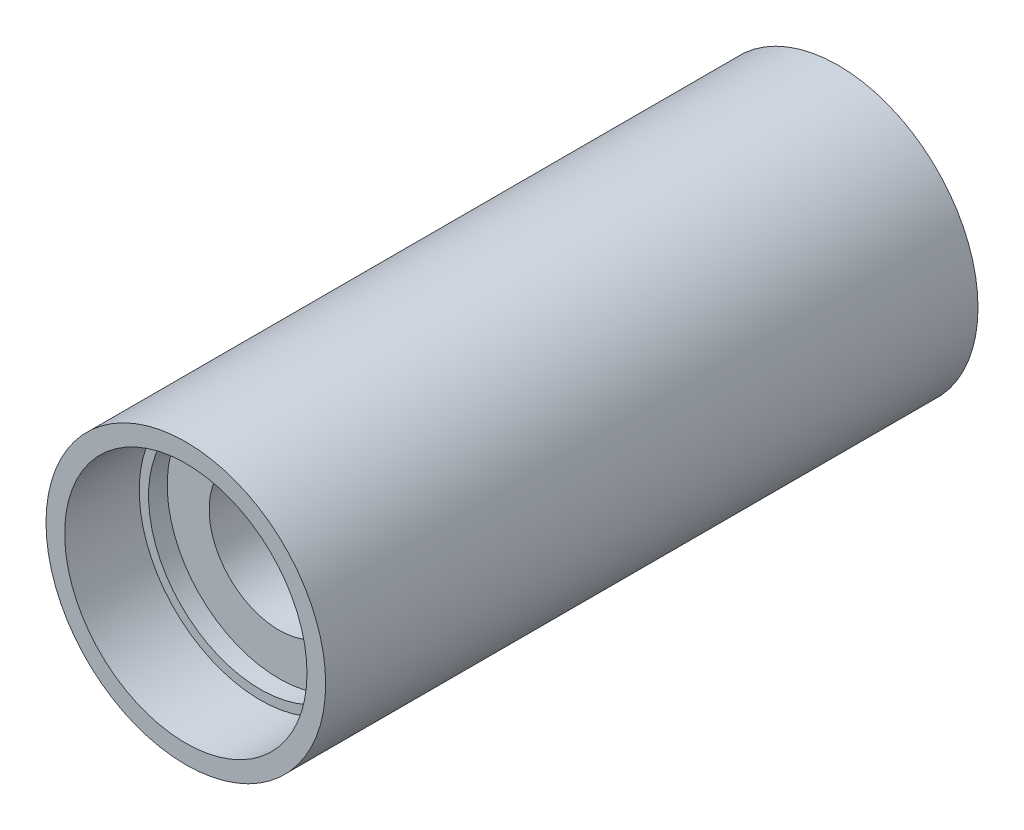
ISO-10303-21;
HEADER;
FILE_DESCRIPTION(('STEP AP214'),'2;1');
FILE_NAME('part.step','',(''),(''),'','','');
FILE_SCHEMA(('AUTOMOTIVE_DESIGN { 1 0 10303 214 1 1 1 1 }'));
ENDSEC;
DATA;
#1=APPLICATION_CONTEXT('core data for automotive mechanical design processes');
#2=APPLICATION_PROTOCOL_DEFINITION('international standard','automotive_design',2000,#1);
#3=PRODUCT_CONTEXT('',#1,'mechanical');
#4=PRODUCT('Part','Part','',(#3));
#5=PRODUCT_RELATED_PRODUCT_CATEGORY('part','',(#4));
#6=PRODUCT_DEFINITION_FORMATION('','',#4);
#7=PRODUCT_DEFINITION_CONTEXT('part definition',#1,'design');
#8=PRODUCT_DEFINITION('design','',#6,#7);
#9=PRODUCT_DEFINITION_SHAPE('','',#8);
#10=(LENGTH_UNIT() NAMED_UNIT(*) SI_UNIT(.MILLI.,.METRE.));
#11=(NAMED_UNIT(*) PLANE_ANGLE_UNIT() SI_UNIT($,.RADIAN.));
#12=(NAMED_UNIT(*) SI_UNIT($,.STERADIAN.) SOLID_ANGLE_UNIT());
#13=UNCERTAINTY_MEASURE_WITH_UNIT(LENGTH_MEASURE(1.E-05),#10,'distance_accuracy_value','');
#14=(GEOMETRIC_REPRESENTATION_CONTEXT(3) GLOBAL_UNCERTAINTY_ASSIGNED_CONTEXT((#13)) GLOBAL_UNIT_ASSIGNED_CONTEXT((#10,
#11,#12)) REPRESENTATION_CONTEXT('',''));
#15=CARTESIAN_POINT('',(0.,0.,0.));
#16=DIRECTION('',(0.,0.,1.));
#17=DIRECTION('',(1.,0.,0.));
#18=AXIS2_PLACEMENT_3D('',#15,#16,#17);
#19=CARTESIAN_POINT('',(0.,0.,1005.2930013898));
#20=DIRECTION('',(0.,0.,1.));
#21=DIRECTION('',(1.,0.,0.));
#22=AXIS2_PLACEMENT_3D('',#19,#20,#21);
#23=CYLINDRICAL_SURFACE('',#22,15.);
#24=CARTESIAN_POINT('',(0.,0.,34.9900146127509));
#25=DIRECTION('',(0.,0.,1.));
#26=DIRECTION('',(1.,0.,0.));
#27=AXIS2_PLACEMENT_3D('',#24,#25,#26);
#28=CIRCLE('',#27,15.);
#29=CARTESIAN_POINT('',(15.,0.,34.9900146127509));
#30=VERTEX_POINT('',#29);
#31=EDGE_CURVE('E56',#30,#30,#28,.T.);
#32=ORIENTED_EDGE('',*,*,#31,.F.);
#33=EDGE_LOOP('',(#32));
#34=FACE_BOUND('',#33,.T.);
#35=CARTESIAN_POINT('',(0.,0.,-34.9900146127509));
#36=DIRECTION('',(0.,0.,1.));
#37=DIRECTION('',(1.,0.,0.));
#38=AXIS2_PLACEMENT_3D('',#35,#36,#37);
#39=CIRCLE('',#38,15.);
#40=CARTESIAN_POINT('',(15.,0.,-34.9900146127509));
#41=VERTEX_POINT('',#40);
#42=EDGE_CURVE('E74',#41,#41,#39,.T.);
#43=ORIENTED_EDGE('',*,*,#42,.T.);
#44=EDGE_LOOP('',(#43));
#45=FACE_BOUND('',#44,.T.);
#46=ADVANCED_FACE('F34',(#34,#45),#23,.T.);
#47=CARTESIAN_POINT('',(0.,0.,1005.2930013898));
#48=DIRECTION('',(0.,0.,1.));
#49=DIRECTION('',(1.,0.,0.));
#50=AXIS2_PLACEMENT_3D('',#47,#48,#49);
#51=CYLINDRICAL_SURFACE('',#50,7.5);
#52=CARTESIAN_POINT('',(0.,0.,24.9900146127512));
#53=DIRECTION('',(0.,0.,1.));
#54=DIRECTION('',(1.,0.,0.));
#55=AXIS2_PLACEMENT_3D('',#52,#53,#54);
#56=CIRCLE('',#55,7.5);
#57=CARTESIAN_POINT('',(7.5,0.,24.9900146127512));
#58=VERTEX_POINT('',#57);
#59=EDGE_CURVE('E10',#58,#58,#56,.T.);
#60=ORIENTED_EDGE('',*,*,#59,.T.);
#61=EDGE_LOOP('',(#60));
#62=FACE_BOUND('',#61,.T.);
#63=CARTESIAN_POINT('',(0.,0.,-24.9900146127512));
#64=DIRECTION('',(0.,0.,1.));
#65=DIRECTION('',(1.,0.,0.));
#66=AXIS2_PLACEMENT_3D('',#63,#64,#65);
#67=CIRCLE('',#66,7.5);
#68=CARTESIAN_POINT('',(7.5,0.,-24.9900146127512));
#69=VERTEX_POINT('',#68);
#70=EDGE_CURVE('E59',#69,#69,#67,.T.);
#71=ORIENTED_EDGE('',*,*,#70,.F.);
#72=EDGE_LOOP('',(#71));
#73=FACE_BOUND('',#72,.T.);
#74=ADVANCED_FACE('F110',(#62,#73),#51,.F.);
#75=CARTESIAN_POINT('',(7.5,0.,24.9900146127512));
#76=DIRECTION('',(0.,0.,1.));
#77=DIRECTION('',(1.,0.,0.));
#78=AXIS2_PLACEMENT_3D('',#75,#76,#77);
#79=PLANE('',#78);
#80=CARTESIAN_POINT('',(0.,0.,24.9900146127512));
#81=DIRECTION('',(0.,0.,1.));
#82=DIRECTION('',(1.,0.,0.));
#83=AXIS2_PLACEMENT_3D('',#80,#81,#82);
#84=CIRCLE('',#83,12.);
#85=CARTESIAN_POINT('',(12.,0.,24.9900146127512));
#86=VERTEX_POINT('',#85);
#87=EDGE_CURVE('E40',#86,#86,#84,.T.);
#88=ORIENTED_EDGE('',*,*,#87,.T.);
#89=EDGE_LOOP('',(#88));
#90=FACE_BOUND('',#89,.T.);
#91=ORIENTED_EDGE('',*,*,#59,.F.);
#92=EDGE_LOOP('',(#91));
#93=FACE_BOUND('',#92,.T.);
#94=ADVANCED_FACE('F112',(#90,#93),#79,.T.);
#95=CARTESIAN_POINT('',(0.,0.,1005.2930013898));
#96=DIRECTION('',(0.,0.,1.));
#97=DIRECTION('',(1.,0.,0.));
#98=AXIS2_PLACEMENT_3D('',#95,#96,#97);
#99=CYLINDRICAL_SURFACE('',#98,12.);
#100=CARTESIAN_POINT('',(0.,0.,26.9900146127512));
#101=DIRECTION('',(0.,0.,1.));
#102=DIRECTION('',(1.,0.,0.));
#103=AXIS2_PLACEMENT_3D('',#100,#101,#102);
#104=CIRCLE('',#103,12.);
#105=CARTESIAN_POINT('',(12.,0.,26.9900146127512));
#106=VERTEX_POINT('',#105);
#107=EDGE_CURVE('E44',#106,#106,#104,.T.);
#108=ORIENTED_EDGE('',*,*,#107,.T.);
#109=EDGE_LOOP('',(#108));
#110=FACE_BOUND('',#109,.T.);
#111=ORIENTED_EDGE('',*,*,#87,.F.);
#112=EDGE_LOOP('',(#111));
#113=FACE_BOUND('',#112,.T.);
#114=ADVANCED_FACE('F117',(#110,#113),#99,.F.);
#115=CARTESIAN_POINT('',(12.,0.,26.9900146127512));
#116=DIRECTION('',(0.,0.,1.));
#117=DIRECTION('',(1.,0.,0.));
#118=AXIS2_PLACEMENT_3D('',#115,#116,#117);
#119=PLANE('',#118);
#120=CARTESIAN_POINT('',(0.,0.,26.9900146127512));
#121=DIRECTION('',(0.,0.,1.));
#122=DIRECTION('',(1.,0.,0.));
#123=AXIS2_PLACEMENT_3D('',#120,#121,#122);
#124=CIRCLE('',#123,13.);
#125=CARTESIAN_POINT('',(13.,0.,26.9900146127512));
#126=VERTEX_POINT('',#125);
#127=EDGE_CURVE('E48',#126,#126,#124,.T.);
#128=ORIENTED_EDGE('',*,*,#127,.T.);
#129=EDGE_LOOP('',(#128));
#130=FACE_BOUND('',#129,.T.);
#131=ORIENTED_EDGE('',*,*,#107,.F.);
#132=EDGE_LOOP('',(#131));
#133=FACE_BOUND('',#132,.T.);
#134=ADVANCED_FACE('F123',(#130,#133),#119,.T.);
#135=CARTESIAN_POINT('',(0.,0.,1005.2930013898));
#136=DIRECTION('',(0.,0.,1.));
#137=DIRECTION('',(1.,0.,0.));
#138=AXIS2_PLACEMENT_3D('',#135,#136,#137);
#139=CYLINDRICAL_SURFACE('',#138,13.);
#140=CARTESIAN_POINT('',(0.,0.,34.9900146127509));
#141=DIRECTION('',(0.,0.,1.));
#142=DIRECTION('',(1.,0.,0.));
#143=AXIS2_PLACEMENT_3D('',#140,#141,#142);
#144=CIRCLE('',#143,13.);
#145=CARTESIAN_POINT('',(13.,0.,34.9900146127509));
#146=VERTEX_POINT('',#145);
#147=EDGE_CURVE('E53',#146,#146,#144,.T.);
#148=ORIENTED_EDGE('',*,*,#147,.T.);
#149=EDGE_LOOP('',(#148));
#150=FACE_BOUND('',#149,.T.);
#151=ORIENTED_EDGE('',*,*,#127,.F.);
#152=EDGE_LOOP('',(#151));
#153=FACE_BOUND('',#152,.T.);
#154=ADVANCED_FACE('F127',(#150,#153),#139,.F.);
#155=CARTESIAN_POINT('',(13.,0.,34.9900146127509));
#156=DIRECTION('',(0.,0.,1.));
#157=DIRECTION('',(1.,0.,0.));
#158=AXIS2_PLACEMENT_3D('',#155,#156,#157);
#159=PLANE('',#158);
#160=ORIENTED_EDGE('',*,*,#31,.T.);
#161=EDGE_LOOP('',(#160));
#162=FACE_BOUND('',#161,.T.);
#163=ORIENTED_EDGE('',*,*,#147,.F.);
#164=EDGE_LOOP('',(#163));
#165=FACE_BOUND('',#164,.T.);
#166=ADVANCED_FACE('F106',(#162,#165),#159,.T.);
#167=CARTESIAN_POINT('',(7.5,0.,-24.9900146127512));
#168=DIRECTION('',(0.,0.,-1.));
#169=DIRECTION('',(1.,0.,0.));
#170=AXIS2_PLACEMENT_3D('',#167,#168,#169);
#171=PLANE('',#170);
#172=CARTESIAN_POINT('',(0.,0.,-24.9900146127512));
#173=DIRECTION('',(0.,0.,1.));
#174=DIRECTION('',(1.,0.,0.));
#175=AXIS2_PLACEMENT_3D('',#172,#173,#174);
#176=CIRCLE('',#175,12.);
#177=CARTESIAN_POINT('',(12.,0.,-24.9900146127512));
#178=VERTEX_POINT('',#177);
#179=EDGE_CURVE('E62',#178,#178,#176,.T.);
#180=ORIENTED_EDGE('',*,*,#179,.F.);
#181=EDGE_LOOP('',(#180));
#182=FACE_BOUND('',#181,.T.);
#183=ORIENTED_EDGE('',*,*,#70,.T.);
#184=EDGE_LOOP('',(#183));
#185=FACE_BOUND('',#184,.T.);
#186=ADVANCED_FACE('F100',(#182,#185),#171,.T.);
#187=CARTESIAN_POINT('',(0.,0.,-1005.2930013898));
#188=DIRECTION('',(0.,0.,-1.));
#189=DIRECTION('',(1.,0.,0.));
#190=AXIS2_PLACEMENT_3D('',#187,#188,#189);
#191=CYLINDRICAL_SURFACE('',#190,12.);
#192=CARTESIAN_POINT('',(0.,0.,-26.9900146127512));
#193=DIRECTION('',(0.,0.,1.));
#194=DIRECTION('',(1.,0.,0.));
#195=AXIS2_PLACEMENT_3D('',#192,#193,#194);
#196=CIRCLE('',#195,12.);
#197=CARTESIAN_POINT('',(12.,0.,-26.9900146127512));
#198=VERTEX_POINT('',#197);
#199=EDGE_CURVE('E65',#198,#198,#196,.T.);
#200=ORIENTED_EDGE('',*,*,#199,.F.);
#201=EDGE_LOOP('',(#200));
#202=FACE_BOUND('',#201,.T.);
#203=ORIENTED_EDGE('',*,*,#179,.T.);
#204=EDGE_LOOP('',(#203));
#205=FACE_BOUND('',#204,.T.);
#206=ADVANCED_FACE('F94',(#202,#205),#191,.F.);
#207=CARTESIAN_POINT('',(12.,0.,-26.9900146127512));
#208=DIRECTION('',(0.,0.,-1.));
#209=DIRECTION('',(1.,0.,0.));
#210=AXIS2_PLACEMENT_3D('',#207,#208,#209);
#211=PLANE('',#210);
#212=CARTESIAN_POINT('',(0.,0.,-26.9900146127512));
#213=DIRECTION('',(0.,0.,1.));
#214=DIRECTION('',(1.,0.,0.));
#215=AXIS2_PLACEMENT_3D('',#212,#213,#214);
#216=CIRCLE('',#215,13.);
#217=CARTESIAN_POINT('',(13.,0.,-26.9900146127512));
#218=VERTEX_POINT('',#217);
#219=EDGE_CURVE('E68',#218,#218,#216,.T.);
#220=ORIENTED_EDGE('',*,*,#219,.F.);
#221=EDGE_LOOP('',(#220));
#222=FACE_BOUND('',#221,.T.);
#223=ORIENTED_EDGE('',*,*,#199,.T.);
#224=EDGE_LOOP('',(#223));
#225=FACE_BOUND('',#224,.T.);
#226=ADVANCED_FACE('F88',(#222,#225),#211,.T.);
#227=CARTESIAN_POINT('',(0.,0.,-1005.2930013898));
#228=DIRECTION('',(0.,0.,-1.));
#229=DIRECTION('',(1.,0.,0.));
#230=AXIS2_PLACEMENT_3D('',#227,#228,#229);
#231=CYLINDRICAL_SURFACE('',#230,13.);
#232=CARTESIAN_POINT('',(0.,0.,-34.9900146127509));
#233=DIRECTION('',(0.,0.,1.));
#234=DIRECTION('',(1.,0.,0.));
#235=AXIS2_PLACEMENT_3D('',#232,#233,#234);
#236=CIRCLE('',#235,13.);
#237=CARTESIAN_POINT('',(13.,0.,-34.9900146127509));
#238=VERTEX_POINT('',#237);
#239=EDGE_CURVE('E71',#238,#238,#236,.T.);
#240=ORIENTED_EDGE('',*,*,#239,.F.);
#241=EDGE_LOOP('',(#240));
#242=FACE_BOUND('',#241,.T.);
#243=ORIENTED_EDGE('',*,*,#219,.T.);
#244=EDGE_LOOP('',(#243));
#245=FACE_BOUND('',#244,.T.);
#246=ADVANCED_FACE('F82',(#242,#245),#231,.F.);
#247=CARTESIAN_POINT('',(13.,0.,-34.9900146127509));
#248=DIRECTION('',(0.,0.,-1.));
#249=DIRECTION('',(1.,0.,0.));
#250=AXIS2_PLACEMENT_3D('',#247,#248,#249);
#251=PLANE('',#250);
#252=ORIENTED_EDGE('',*,*,#42,.F.);
#253=EDGE_LOOP('',(#252));
#254=FACE_BOUND('',#253,.T.);
#255=ORIENTED_EDGE('',*,*,#239,.T.);
#256=EDGE_LOOP('',(#255));
#257=FACE_BOUND('',#256,.T.);
#258=ADVANCED_FACE('F79',(#254,#257),#251,.T.);
#259=CLOSED_SHELL('',(#46,#74,#94,#114,#134,#154,#166,#186,#206,#226,#246,#258));
#260=MANIFOLD_SOLID_BREP('B2',#259);
#261=ADVANCED_BREP_SHAPE_REPRESENTATION('',(#18,#260),#14);
#262=SHAPE_DEFINITION_REPRESENTATION(#9,#261);
ENDSEC;
END-ISO-10303-21;
